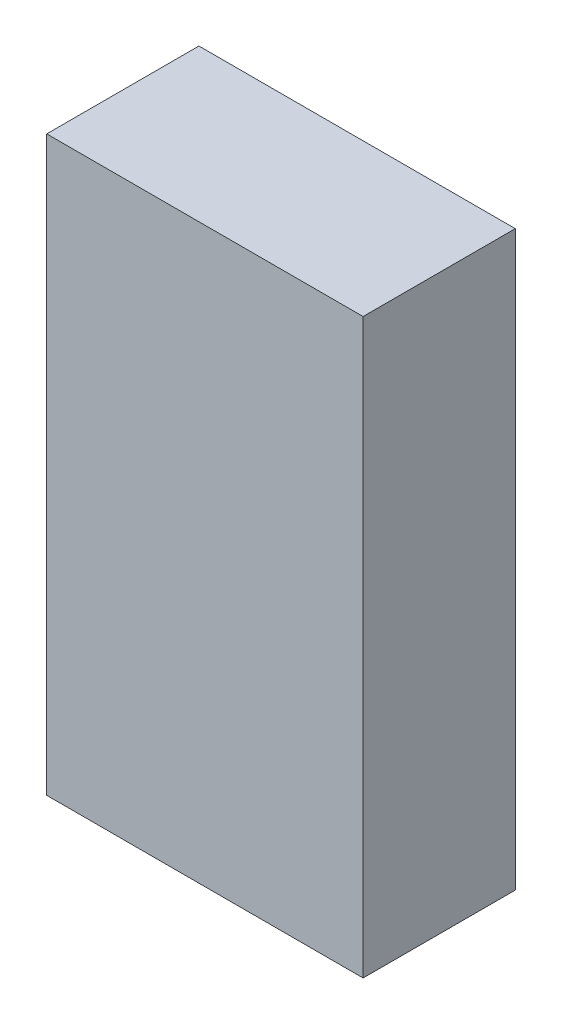
ISO-10303-21;
HEADER;
FILE_DESCRIPTION(('STEP AP214'),'2;1');
FILE_NAME('part.step','',(''),(''),'','','');
FILE_SCHEMA(('AUTOMOTIVE_DESIGN { 1 0 10303 214 1 1 1 1 }'));
ENDSEC;
DATA;
#1=APPLICATION_CONTEXT('core data for automotive mechanical design processes');
#2=APPLICATION_PROTOCOL_DEFINITION('international standard','automotive_design',2000,#1);
#3=PRODUCT_CONTEXT('',#1,'mechanical');
#4=PRODUCT('Part','Part','',(#3));
#5=PRODUCT_RELATED_PRODUCT_CATEGORY('part','',(#4));
#6=PRODUCT_DEFINITION_FORMATION('','',#4);
#7=PRODUCT_DEFINITION_CONTEXT('part definition',#1,'design');
#8=PRODUCT_DEFINITION('design','',#6,#7);
#9=PRODUCT_DEFINITION_SHAPE('','',#8);
#10=(LENGTH_UNIT() NAMED_UNIT(*) SI_UNIT(.MILLI.,.METRE.));
#11=(NAMED_UNIT(*) PLANE_ANGLE_UNIT() SI_UNIT($,.RADIAN.));
#12=(NAMED_UNIT(*) SI_UNIT($,.STERADIAN.) SOLID_ANGLE_UNIT());
#13=UNCERTAINTY_MEASURE_WITH_UNIT(LENGTH_MEASURE(1.E-05),#10,'distance_accuracy_value','');
#14=(GEOMETRIC_REPRESENTATION_CONTEXT(3) GLOBAL_UNCERTAINTY_ASSIGNED_CONTEXT((#13)) GLOBAL_UNIT_ASSIGNED_CONTEXT((#10,
#11,#12)) REPRESENTATION_CONTEXT('',''));
#15=CARTESIAN_POINT('',(0.,0.,0.));
#16=DIRECTION('',(0.,0.,1.));
#17=DIRECTION('',(1.,0.,0.));
#18=AXIS2_PLACEMENT_3D('',#15,#16,#17);
#19=CARTESIAN_POINT('',(-1.84999884,3.35000092,1.77999898));
#20=DIRECTION('',(0.,0.,-1.));
#21=DIRECTION('',(-1.,0.,0.));
#22=AXIS2_PLACEMENT_3D('',#19,#20,#21);
#23=PLANE('',#22);
#24=DIRECTION('',(1.,0.,0.));
#25=VECTOR('',#24,1.);
#26=CARTESIAN_POINT('',(-1.84999884,-3.34999838,1.77999898));
#27=LINE('',#26,#25);
#28=CARTESIAN_POINT('',(-1.84999884,-3.34999838,1.77999898));
#29=VERTEX_POINT('',#28);
#30=CARTESIAN_POINT('',(1.85000138,-3.34999838,1.77999898));
#31=VERTEX_POINT('',#30);
#32=EDGE_CURVE('E54',#29,#31,#27,.T.);
#33=ORIENTED_EDGE('',*,*,#32,.T.);
#34=DIRECTION('',(0.,1.,0.));
#35=VECTOR('',#34,1.);
#36=CARTESIAN_POINT('',(1.85000138,-3.34999838,1.77999898));
#37=LINE('',#36,#35);
#38=CARTESIAN_POINT('',(1.85000138,3.35000092,1.77999898));
#39=VERTEX_POINT('',#38);
#40=EDGE_CURVE('E56',#31,#39,#37,.T.);
#41=ORIENTED_EDGE('',*,*,#40,.T.);
#42=DIRECTION('',(1.,0.,0.));
#43=VECTOR('',#42,1.);
#44=CARTESIAN_POINT('',(1.85000138,3.35000092,1.77999898));
#45=LINE('',#44,#43);
#46=CARTESIAN_POINT('',(-1.84999884,3.35000092,1.77999898));
#47=VERTEX_POINT('',#46);
#48=EDGE_CURVE('E19',#39,#47,#45,.F.);
#49=ORIENTED_EDGE('',*,*,#48,.T.);
#50=DIRECTION('',(0.,1.,0.));
#51=VECTOR('',#50,1.);
#52=CARTESIAN_POINT('',(-1.84999884,3.35000092,1.77999898));
#53=LINE('',#52,#51);
#54=EDGE_CURVE('E79',#47,#29,#53,.F.);
#55=ORIENTED_EDGE('',*,*,#54,.T.);
#56=EDGE_LOOP('',(#33,#41,#49,#55));
#57=FACE_BOUND('',#56,.T.);
#58=ADVANCED_FACE('F16',(#57),#23,.F.);
#59=CARTESIAN_POINT('',(1.85000138,3.35000092,0.));
#60=DIRECTION('',(0.,-1.,0.));
#61=DIRECTION('',(0.,0.,-1.));
#62=AXIS2_PLACEMENT_3D('',#59,#60,#61);
#63=PLANE('',#62);
#64=DIRECTION('',(0.,0.,-1.));
#65=VECTOR('',#64,1.);
#66=CARTESIAN_POINT('',(-1.84999884,3.35000092,0.));
#67=LINE('',#66,#65);
#68=CARTESIAN_POINT('',(-1.84999884,3.35000092,0.));
#69=VERTEX_POINT('',#68);
#70=EDGE_CURVE('E67',#69,#47,#67,.F.);
#71=ORIENTED_EDGE('',*,*,#70,.T.);
#72=ORIENTED_EDGE('',*,*,#48,.F.);
#73=DIRECTION('',(0.,0.,1.));
#74=VECTOR('',#73,1.);
#75=CARTESIAN_POINT('',(1.85000138,3.35000092,0.));
#76=LINE('',#75,#74);
#77=CARTESIAN_POINT('',(1.85000138,3.35000092,0.));
#78=VERTEX_POINT('',#77);
#79=EDGE_CURVE('E62',#39,#78,#76,.F.);
#80=ORIENTED_EDGE('',*,*,#79,.T.);
#81=DIRECTION('',(-1.,0.,0.));
#82=VECTOR('',#81,1.);
#83=CARTESIAN_POINT('',(-1.84999884,3.35000092,0.));
#84=LINE('',#83,#82);
#85=EDGE_CURVE('E82',#69,#78,#84,.F.);
#86=ORIENTED_EDGE('',*,*,#85,.F.);
#87=EDGE_LOOP('',(#71,#72,#80,#86));
#88=FACE_BOUND('',#87,.T.);
#89=ADVANCED_FACE('F64',(#88),#63,.F.);
#90=CARTESIAN_POINT('',(1.85000138,-3.34999838,0.));
#91=DIRECTION('',(-1.,0.,0.));
#92=DIRECTION('',(0.,0.,1.));
#93=AXIS2_PLACEMENT_3D('',#90,#91,#92);
#94=PLANE('',#93);
#95=ORIENTED_EDGE('',*,*,#79,.F.);
#96=ORIENTED_EDGE('',*,*,#40,.F.);
#97=DIRECTION('',(0.,0.,1.));
#98=VECTOR('',#97,1.);
#99=CARTESIAN_POINT('',(1.85000138,-3.34999838,0.));
#100=LINE('',#99,#98);
#101=CARTESIAN_POINT('',(1.85000138,-3.34999838,0.));
#102=VERTEX_POINT('',#101);
#103=EDGE_CURVE('E74',#31,#102,#100,.F.);
#104=ORIENTED_EDGE('',*,*,#103,.T.);
#105=DIRECTION('',(0.,1.,0.));
#106=VECTOR('',#105,1.);
#107=CARTESIAN_POINT('',(1.85000138,3.35000092,0.));
#108=LINE('',#107,#106);
#109=EDGE_CURVE('E71',#78,#102,#108,.F.);
#110=ORIENTED_EDGE('',*,*,#109,.F.);
#111=EDGE_LOOP('',(#95,#96,#104,#110));
#112=FACE_BOUND('',#111,.T.);
#113=ADVANCED_FACE('F69',(#112),#94,.F.);
#114=CARTESIAN_POINT('',(-1.84999884,-3.34999838,0.));
#115=DIRECTION('',(0.,1.,0.));
#116=DIRECTION('',(0.,0.,1.));
#117=AXIS2_PLACEMENT_3D('',#114,#115,#116);
#118=PLANE('',#117);
#119=ORIENTED_EDGE('',*,*,#103,.F.);
#120=ORIENTED_EDGE('',*,*,#32,.F.);
#121=DIRECTION('',(0.,0.,-1.));
#122=VECTOR('',#121,1.);
#123=CARTESIAN_POINT('',(-1.84999884,-3.34999838,0.));
#124=LINE('',#123,#122);
#125=CARTESIAN_POINT('',(-1.84999884,-3.34999838,0.));
#126=VERTEX_POINT('',#125);
#127=EDGE_CURVE('E34',#29,#126,#124,.T.);
#128=ORIENTED_EDGE('',*,*,#127,.T.);
#129=DIRECTION('',(-1.,0.,0.));
#130=VECTOR('',#129,1.);
#131=CARTESIAN_POINT('',(-1.84999884,-3.34999838,0.));
#132=LINE('',#131,#130);
#133=EDGE_CURVE('E25',#102,#126,#132,.T.);
#134=ORIENTED_EDGE('',*,*,#133,.F.);
#135=EDGE_LOOP('',(#119,#120,#128,#134));
#136=FACE_BOUND('',#135,.T.);
#137=ADVANCED_FACE('F88',(#136),#118,.F.);
#138=CARTESIAN_POINT('',(-1.84999884,3.35000092,0.));
#139=DIRECTION('',(1.,0.,0.));
#140=DIRECTION('',(0.,0.,-1.));
#141=AXIS2_PLACEMENT_3D('',#138,#139,#140);
#142=PLANE('',#141);
#143=ORIENTED_EDGE('',*,*,#127,.F.);
#144=ORIENTED_EDGE('',*,*,#54,.F.);
#145=ORIENTED_EDGE('',*,*,#70,.F.);
#146=DIRECTION('',(0.,1.,0.));
#147=VECTOR('',#146,1.);
#148=CARTESIAN_POINT('',(-1.84999884,3.35000092,0.));
#149=LINE('',#148,#147);
#150=EDGE_CURVE('E11',#126,#69,#149,.T.);
#151=ORIENTED_EDGE('',*,*,#150,.F.);
#152=EDGE_LOOP('',(#143,#144,#145,#151));
#153=FACE_BOUND('',#152,.T.);
#154=ADVANCED_FACE('F90',(#153),#142,.F.);
#155=CARTESIAN_POINT('',(-1.84999884,3.35000092,0.));
#156=DIRECTION('',(0.,0.,-1.));
#157=DIRECTION('',(-1.,0.,0.));
#158=AXIS2_PLACEMENT_3D('',#155,#156,#157);
#159=PLANE('',#158);
#160=ORIENTED_EDGE('',*,*,#133,.T.);
#161=ORIENTED_EDGE('',*,*,#150,.T.);
#162=ORIENTED_EDGE('',*,*,#85,.T.);
#163=ORIENTED_EDGE('',*,*,#109,.T.);
#164=EDGE_LOOP('',(#160,#161,#162,#163));
#165=FACE_BOUND('',#164,.T.);
#166=ADVANCED_FACE('F87',(#165),#159,.T.);
#167=CLOSED_SHELL('',(#58,#89,#113,#137,#154,#166));
#168=MANIFOLD_SOLID_BREP('B1',#167);
#169=ADVANCED_BREP_SHAPE_REPRESENTATION('',(#18,#168),#14);
#170=SHAPE_DEFINITION_REPRESENTATION(#9,#169);
ENDSEC;
END-ISO-10303-21;
